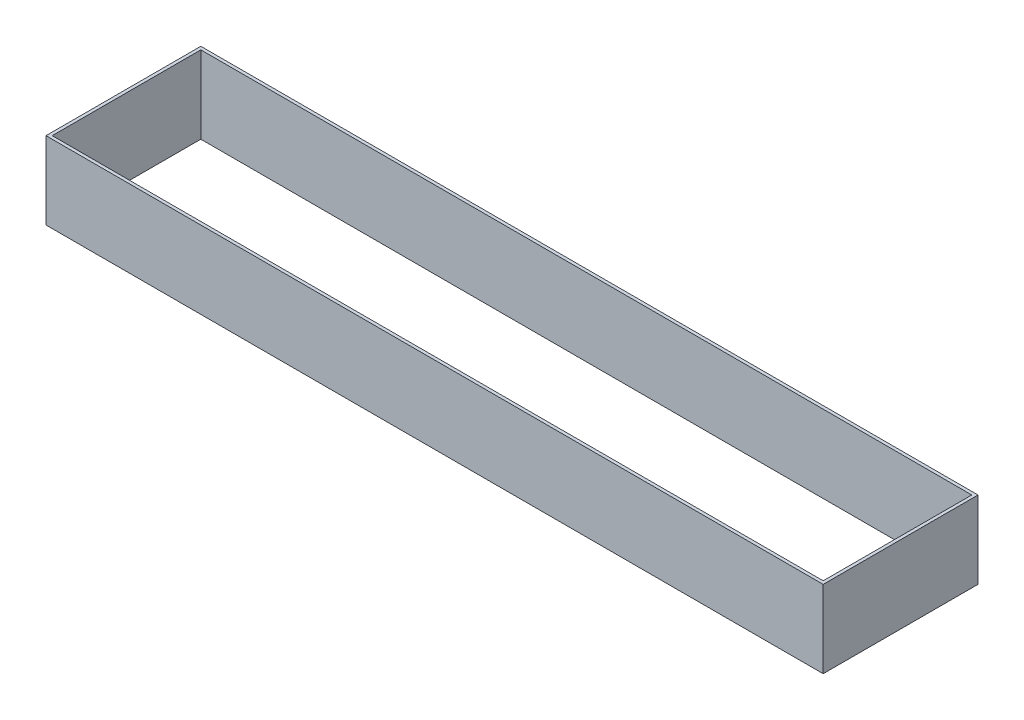
ISO-10303-21;
HEADER;
FILE_DESCRIPTION(('STEP AP214'),'2;1');
FILE_NAME('part.step','',(''),(''),'','','');
FILE_SCHEMA(('AUTOMOTIVE_DESIGN { 1 0 10303 214 1 1 1 1 }'));
ENDSEC;
DATA;
#1=APPLICATION_CONTEXT('core data for automotive mechanical design processes');
#2=APPLICATION_PROTOCOL_DEFINITION('international standard','automotive_design',2000,#1);
#3=PRODUCT_CONTEXT('',#1,'mechanical');
#4=PRODUCT('Part','Part','',(#3));
#5=PRODUCT_RELATED_PRODUCT_CATEGORY('part','',(#4));
#6=PRODUCT_DEFINITION_FORMATION('','',#4);
#7=PRODUCT_DEFINITION_CONTEXT('part definition',#1,'design');
#8=PRODUCT_DEFINITION('design','',#6,#7);
#9=PRODUCT_DEFINITION_SHAPE('','',#8);
#10=(LENGTH_UNIT() NAMED_UNIT(*) SI_UNIT(.MILLI.,.METRE.));
#11=(NAMED_UNIT(*) PLANE_ANGLE_UNIT() SI_UNIT($,.RADIAN.));
#12=(NAMED_UNIT(*) SI_UNIT($,.STERADIAN.) SOLID_ANGLE_UNIT());
#13=UNCERTAINTY_MEASURE_WITH_UNIT(LENGTH_MEASURE(1.E-05),#10,'distance_accuracy_value','');
#14=(GEOMETRIC_REPRESENTATION_CONTEXT(3) GLOBAL_UNCERTAINTY_ASSIGNED_CONTEXT((#13)) GLOBAL_UNIT_ASSIGNED_CONTEXT((#10,
#11,#12)) REPRESENTATION_CONTEXT('',''));
#15=CARTESIAN_POINT('',(0.,0.,0.));
#16=DIRECTION('',(0.,0.,1.));
#17=DIRECTION('',(1.,0.,0.));
#18=AXIS2_PLACEMENT_3D('',#15,#16,#17);
#19=CARTESIAN_POINT('',(0.,10.,0.));
#20=DIRECTION('',(0.,-1.,0.));
#21=DIRECTION('',(0.,0.,-1.));
#22=AXIS2_PLACEMENT_3D('',#19,#20,#21);
#23=PLANE('',#22);
#24=DIRECTION('',(0.,0.,1.));
#25=VECTOR('',#24,1.);
#26=CARTESIAN_POINT('',(0.,10.,0.));
#27=LINE('',#26,#25);
#28=CARTESIAN_POINT('',(0.,10.,-20.));
#29=VERTEX_POINT('',#28);
#30=CARTESIAN_POINT('',(0.,10.,0.));
#31=VERTEX_POINT('',#30);
#32=EDGE_CURVE('E140',#29,#31,#27,.T.);
#33=ORIENTED_EDGE('',*,*,#32,.T.);
#34=DIRECTION('',(1.,0.,0.));
#35=VECTOR('',#34,1.);
#36=CARTESIAN_POINT('',(0.,10.,0.));
#37=LINE('',#36,#35);
#38=CARTESIAN_POINT('',(100.4,10.,0.));
#39=VERTEX_POINT('',#38);
#40=EDGE_CURVE('E143',#31,#39,#37,.T.);
#41=ORIENTED_EDGE('',*,*,#40,.T.);
#42=DIRECTION('',(0.,0.,-1.));
#43=VECTOR('',#42,1.);
#44=CARTESIAN_POINT('',(100.4,10.,0.));
#45=LINE('',#44,#43);
#46=CARTESIAN_POINT('',(100.4,10.,-20.));
#47=VERTEX_POINT('',#46);
#48=EDGE_CURVE('E146',#39,#47,#45,.T.);
#49=ORIENTED_EDGE('',*,*,#48,.T.);
#50=DIRECTION('',(-1.,0.,0.));
#51=VECTOR('',#50,1.);
#52=CARTESIAN_POINT('',(0.,10.,-20.));
#53=LINE('',#52,#51);
#54=EDGE_CURVE('E148',#47,#29,#53,.T.);
#55=ORIENTED_EDGE('',*,*,#54,.T.);
#56=EDGE_LOOP('',(#33,#41,#49,#55));
#57=FACE_BOUND('',#56,.T.);
#58=DIRECTION('',(0.,0.,1.));
#59=VECTOR('',#58,1.);
#60=CARTESIAN_POINT('',(0.4,10.,-0.4));
#61=LINE('',#60,#59);
#62=CARTESIAN_POINT('',(0.4,10.,-19.6));
#63=VERTEX_POINT('',#62);
#64=CARTESIAN_POINT('',(0.4,10.,-0.4));
#65=VERTEX_POINT('',#64);
#66=EDGE_CURVE('E104',#63,#65,#61,.T.);
#67=ORIENTED_EDGE('',*,*,#66,.F.);
#68=DIRECTION('',(-1.,0.,0.));
#69=VECTOR('',#68,1.);
#70=CARTESIAN_POINT('',(0.4,10.,-19.6));
#71=LINE('',#70,#69);
#72=CARTESIAN_POINT('',(100.,10.,-19.6));
#73=VERTEX_POINT('',#72);
#74=EDGE_CURVE('E126',#73,#63,#71,.T.);
#75=ORIENTED_EDGE('',*,*,#74,.F.);
#76=DIRECTION('',(0.,0.,-1.));
#77=VECTOR('',#76,1.);
#78=CARTESIAN_POINT('',(100.,10.,-0.4));
#79=LINE('',#78,#77);
#80=CARTESIAN_POINT('',(100.,10.,-0.4));
#81=VERTEX_POINT('',#80);
#82=EDGE_CURVE('E124',#81,#73,#79,.T.);
#83=ORIENTED_EDGE('',*,*,#82,.F.);
#84=DIRECTION('',(1.,0.,0.));
#85=VECTOR('',#84,1.);
#86=CARTESIAN_POINT('',(0.4,10.,-0.4));
#87=LINE('',#86,#85);
#88=EDGE_CURVE('E112',#65,#81,#87,.T.);
#89=ORIENTED_EDGE('',*,*,#88,.F.);
#90=EDGE_LOOP('',(#67,#75,#83,#89));
#91=FACE_BOUND('',#90,.T.);
#92=ADVANCED_FACE('F39',(#57,#91),#23,.F.);
#93=CARTESIAN_POINT('',(0.,0.,0.));
#94=DIRECTION('',(0.,-1.,0.));
#95=DIRECTION('',(0.,0.,-1.));
#96=AXIS2_PLACEMENT_3D('',#93,#94,#95);
#97=PLANE('',#96);
#98=DIRECTION('',(0.,0.,1.));
#99=VECTOR('',#98,1.);
#100=CARTESIAN_POINT('',(0.,0.,0.));
#101=LINE('',#100,#99);
#102=CARTESIAN_POINT('',(0.,0.,-20.));
#103=VERTEX_POINT('',#102);
#104=CARTESIAN_POINT('',(0.,0.,0.));
#105=VERTEX_POINT('',#104);
#106=EDGE_CURVE('E120',#103,#105,#101,.T.);
#107=ORIENTED_EDGE('',*,*,#106,.F.);
#108=DIRECTION('',(-1.,0.,0.));
#109=VECTOR('',#108,1.);
#110=CARTESIAN_POINT('',(0.,0.,-20.));
#111=LINE('',#110,#109);
#112=CARTESIAN_POINT('',(100.4,0.,-20.));
#113=VERTEX_POINT('',#112);
#114=EDGE_CURVE('E144',#113,#103,#111,.T.);
#115=ORIENTED_EDGE('',*,*,#114,.F.);
#116=DIRECTION('',(0.,0.,-1.));
#117=VECTOR('',#116,1.);
#118=CARTESIAN_POINT('',(100.4,0.,0.));
#119=LINE('',#118,#117);
#120=CARTESIAN_POINT('',(100.4,0.,0.));
#121=VERTEX_POINT('',#120);
#122=EDGE_CURVE('E155',#121,#113,#119,.T.);
#123=ORIENTED_EDGE('',*,*,#122,.F.);
#124=DIRECTION('',(1.,0.,0.));
#125=VECTOR('',#124,1.);
#126=CARTESIAN_POINT('',(0.,0.,0.));
#127=LINE('',#126,#125);
#128=EDGE_CURVE('E153',#105,#121,#127,.T.);
#129=ORIENTED_EDGE('',*,*,#128,.F.);
#130=EDGE_LOOP('',(#107,#115,#123,#129));
#131=FACE_BOUND('',#130,.T.);
#132=DIRECTION('',(-1.,0.,0.));
#133=VECTOR('',#132,1.);
#134=CARTESIAN_POINT('',(0.4,0.,-19.6));
#135=LINE('',#134,#133);
#136=CARTESIAN_POINT('',(100.,0.,-19.6));
#137=VERTEX_POINT('',#136);
#138=CARTESIAN_POINT('',(0.4,0.,-19.6));
#139=VERTEX_POINT('',#138);
#140=EDGE_CURVE('E113',#137,#139,#135,.T.);
#141=ORIENTED_EDGE('',*,*,#140,.T.);
#142=DIRECTION('',(0.,0.,1.));
#143=VECTOR('',#142,1.);
#144=CARTESIAN_POINT('',(0.4,0.,-0.4));
#145=LINE('',#144,#143);
#146=CARTESIAN_POINT('',(0.4,0.,-0.4));
#147=VERTEX_POINT('',#146);
#148=EDGE_CURVE('E62',#139,#147,#145,.T.);
#149=ORIENTED_EDGE('',*,*,#148,.T.);
#150=DIRECTION('',(1.,0.,0.));
#151=VECTOR('',#150,1.);
#152=CARTESIAN_POINT('',(0.4,0.,-0.4));
#153=LINE('',#152,#151);
#154=CARTESIAN_POINT('',(100.,0.,-0.4));
#155=VERTEX_POINT('',#154);
#156=EDGE_CURVE('E119',#147,#155,#153,.T.);
#157=ORIENTED_EDGE('',*,*,#156,.T.);
#158=DIRECTION('',(0.,0.,-1.));
#159=VECTOR('',#158,1.);
#160=CARTESIAN_POINT('',(100.,0.,-0.4));
#161=LINE('',#160,#159);
#162=EDGE_CURVE('E132',#155,#137,#161,.T.);
#163=ORIENTED_EDGE('',*,*,#162,.T.);
#164=EDGE_LOOP('',(#141,#149,#157,#163));
#165=FACE_BOUND('',#164,.T.);
#166=ADVANCED_FACE('F173',(#131,#165),#97,.T.);
#167=CARTESIAN_POINT('',(0.,10.,0.));
#168=DIRECTION('',(1.,0.,0.));
#169=DIRECTION('',(0.,0.,-1.));
#170=AXIS2_PLACEMENT_3D('',#167,#168,#169);
#171=PLANE('',#170);
#172=ORIENTED_EDGE('',*,*,#106,.T.);
#173=DIRECTION('',(0.,-1.,0.));
#174=VECTOR('',#173,1.);
#175=CARTESIAN_POINT('',(0.,10.,0.));
#176=LINE('',#175,#174);
#177=EDGE_CURVE('E11',#31,#105,#176,.T.);
#178=ORIENTED_EDGE('',*,*,#177,.F.);
#179=ORIENTED_EDGE('',*,*,#32,.F.);
#180=DIRECTION('',(0.,-1.,0.));
#181=VECTOR('',#180,1.);
#182=CARTESIAN_POINT('',(0.,10.,-20.));
#183=LINE('',#182,#181);
#184=EDGE_CURVE('E150',#29,#103,#183,.T.);
#185=ORIENTED_EDGE('',*,*,#184,.T.);
#186=EDGE_LOOP('',(#172,#178,#179,#185));
#187=FACE_BOUND('',#186,.T.);
#188=ADVANCED_FACE('F41',(#187),#171,.F.);
#189=CARTESIAN_POINT('',(0.,10.,0.));
#190=DIRECTION('',(0.,0.,-1.));
#191=DIRECTION('',(-1.,0.,0.));
#192=AXIS2_PLACEMENT_3D('',#189,#190,#191);
#193=PLANE('',#192);
#194=ORIENTED_EDGE('',*,*,#128,.T.);
#195=DIRECTION('',(0.,-1.,0.));
#196=VECTOR('',#195,1.);
#197=CARTESIAN_POINT('',(100.4,10.,0.));
#198=LINE('',#197,#196);
#199=EDGE_CURVE('E47',#39,#121,#198,.T.);
#200=ORIENTED_EDGE('',*,*,#199,.F.);
#201=ORIENTED_EDGE('',*,*,#40,.F.);
#202=ORIENTED_EDGE('',*,*,#177,.T.);
#203=EDGE_LOOP('',(#194,#200,#201,#202));
#204=FACE_BOUND('',#203,.T.);
#205=ADVANCED_FACE('F183',(#204),#193,.F.);
#206=CARTESIAN_POINT('',(100.4,10.,0.));
#207=DIRECTION('',(-1.,0.,0.));
#208=DIRECTION('',(0.,0.,1.));
#209=AXIS2_PLACEMENT_3D('',#206,#207,#208);
#210=PLANE('',#209);
#211=ORIENTED_EDGE('',*,*,#122,.T.);
#212=DIRECTION('',(0.,-1.,0.));
#213=VECTOR('',#212,1.);
#214=CARTESIAN_POINT('',(100.4,10.,-20.));
#215=LINE('',#214,#213);
#216=EDGE_CURVE('E160',#47,#113,#215,.T.);
#217=ORIENTED_EDGE('',*,*,#216,.F.);
#218=ORIENTED_EDGE('',*,*,#48,.F.);
#219=ORIENTED_EDGE('',*,*,#199,.T.);
#220=EDGE_LOOP('',(#211,#217,#218,#219));
#221=FACE_BOUND('',#220,.T.);
#222=ADVANCED_FACE('F167',(#221),#210,.F.);
#223=CARTESIAN_POINT('',(0.,10.,-20.));
#224=DIRECTION('',(0.,0.,1.));
#225=DIRECTION('',(1.,0.,0.));
#226=AXIS2_PLACEMENT_3D('',#223,#224,#225);
#227=PLANE('',#226);
#228=ORIENTED_EDGE('',*,*,#114,.T.);
#229=ORIENTED_EDGE('',*,*,#184,.F.);
#230=ORIENTED_EDGE('',*,*,#54,.F.);
#231=ORIENTED_EDGE('',*,*,#216,.T.);
#232=EDGE_LOOP('',(#228,#229,#230,#231));
#233=FACE_BOUND('',#232,.T.);
#234=ADVANCED_FACE('F177',(#233),#227,.F.);
#235=CARTESIAN_POINT('',(0.4,10.,-0.4));
#236=DIRECTION('',(1.,0.,0.));
#237=DIRECTION('',(0.,0.,-1.));
#238=AXIS2_PLACEMENT_3D('',#235,#236,#237);
#239=PLANE('',#238);
#240=ORIENTED_EDGE('',*,*,#148,.F.);
#241=DIRECTION('',(0.,-1.,0.));
#242=VECTOR('',#241,1.);
#243=CARTESIAN_POINT('',(0.4,10.,-19.6));
#244=LINE('',#243,#242);
#245=EDGE_CURVE('E108',#63,#139,#244,.T.);
#246=ORIENTED_EDGE('',*,*,#245,.F.);
#247=ORIENTED_EDGE('',*,*,#66,.T.);
#248=DIRECTION('',(0.,-1.,0.));
#249=VECTOR('',#248,1.);
#250=CARTESIAN_POINT('',(0.4,10.,-0.4));
#251=LINE('',#250,#249);
#252=EDGE_CURVE('E107',#65,#147,#251,.T.);
#253=ORIENTED_EDGE('',*,*,#252,.T.);
#254=EDGE_LOOP('',(#240,#246,#247,#253));
#255=FACE_BOUND('',#254,.T.);
#256=ADVANCED_FACE('F106',(#255),#239,.T.);
#257=CARTESIAN_POINT('',(0.4,10.,-0.4));
#258=DIRECTION('',(0.,0.,-1.));
#259=DIRECTION('',(-1.,0.,0.));
#260=AXIS2_PLACEMENT_3D('',#257,#258,#259);
#261=PLANE('',#260);
#262=ORIENTED_EDGE('',*,*,#156,.F.);
#263=ORIENTED_EDGE('',*,*,#252,.F.);
#264=ORIENTED_EDGE('',*,*,#88,.T.);
#265=DIRECTION('',(0.,-1.,0.));
#266=VECTOR('',#265,1.);
#267=CARTESIAN_POINT('',(100.,10.,-0.4));
#268=LINE('',#267,#266);
#269=EDGE_CURVE('E121',#81,#155,#268,.T.);
#270=ORIENTED_EDGE('',*,*,#269,.T.);
#271=EDGE_LOOP('',(#262,#263,#264,#270));
#272=FACE_BOUND('',#271,.T.);
#273=ADVANCED_FACE('F116',(#272),#261,.T.);
#274=CARTESIAN_POINT('',(100.,10.,-0.4));
#275=DIRECTION('',(-1.,0.,0.));
#276=DIRECTION('',(0.,0.,1.));
#277=AXIS2_PLACEMENT_3D('',#274,#275,#276);
#278=PLANE('',#277);
#279=ORIENTED_EDGE('',*,*,#162,.F.);
#280=ORIENTED_EDGE('',*,*,#269,.F.);
#281=ORIENTED_EDGE('',*,*,#82,.T.);
#282=DIRECTION('',(0.,-1.,0.));
#283=VECTOR('',#282,1.);
#284=CARTESIAN_POINT('',(100.,10.,-19.6));
#285=LINE('',#284,#283);
#286=EDGE_CURVE('E54',#73,#137,#285,.T.);
#287=ORIENTED_EDGE('',*,*,#286,.T.);
#288=EDGE_LOOP('',(#279,#280,#281,#287));
#289=FACE_BOUND('',#288,.T.);
#290=ADVANCED_FACE('F206',(#289),#278,.T.);
#291=CARTESIAN_POINT('',(0.4,10.,-19.6));
#292=DIRECTION('',(0.,0.,1.));
#293=DIRECTION('',(1.,0.,0.));
#294=AXIS2_PLACEMENT_3D('',#291,#292,#293);
#295=PLANE('',#294);
#296=ORIENTED_EDGE('',*,*,#140,.F.);
#297=ORIENTED_EDGE('',*,*,#286,.F.);
#298=ORIENTED_EDGE('',*,*,#74,.T.);
#299=ORIENTED_EDGE('',*,*,#245,.T.);
#300=EDGE_LOOP('',(#296,#297,#298,#299));
#301=FACE_BOUND('',#300,.T.);
#302=ADVANCED_FACE('F210',(#301),#295,.T.);
#303=CLOSED_SHELL('',(#92,#166,#188,#205,#222,#234,#256,#273,#290,#302));
#304=MANIFOLD_SOLID_BREP('B2',#303);
#305=ADVANCED_BREP_SHAPE_REPRESENTATION('',(#18,#304),#14);
#306=SHAPE_DEFINITION_REPRESENTATION(#9,#305);
ENDSEC;
END-ISO-10303-21;
